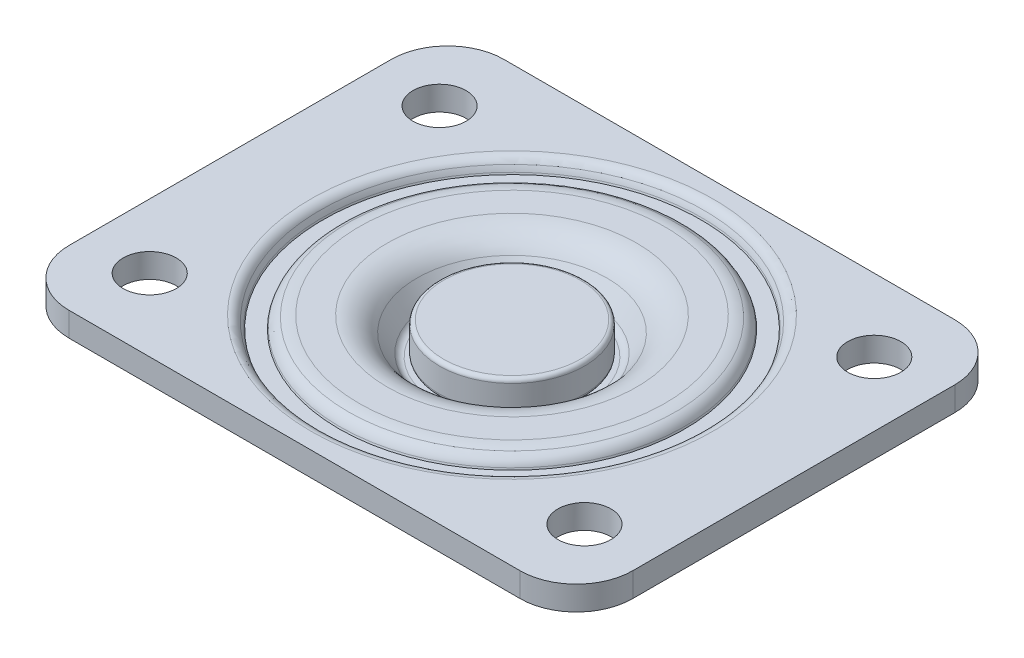
ISO-10303-21;
HEADER;
FILE_DESCRIPTION(('STEP AP214'),'2;1');
FILE_NAME('part.step','',(''),(''),'','','');
FILE_SCHEMA(('AUTOMOTIVE_DESIGN { 1 0 10303 214 1 1 1 1 }'));
ENDSEC;
DATA;
#1=APPLICATION_CONTEXT('core data for automotive mechanical design processes');
#2=APPLICATION_PROTOCOL_DEFINITION('international standard','automotive_design',2000,#1);
#3=PRODUCT_CONTEXT('',#1,'mechanical');
#4=PRODUCT('Part','Part','',(#3));
#5=PRODUCT_RELATED_PRODUCT_CATEGORY('part','',(#4));
#6=PRODUCT_DEFINITION_FORMATION('','',#4);
#7=PRODUCT_DEFINITION_CONTEXT('part definition',#1,'design');
#8=PRODUCT_DEFINITION('design','',#6,#7);
#9=PRODUCT_DEFINITION_SHAPE('','',#8);
#10=(LENGTH_UNIT() NAMED_UNIT(*) SI_UNIT(.MILLI.,.METRE.));
#11=(NAMED_UNIT(*) PLANE_ANGLE_UNIT() SI_UNIT($,.RADIAN.));
#12=(NAMED_UNIT(*) SI_UNIT($,.STERADIAN.) SOLID_ANGLE_UNIT());
#13=UNCERTAINTY_MEASURE_WITH_UNIT(LENGTH_MEASURE(1.E-05),#10,'distance_accuracy_value','');
#14=(GEOMETRIC_REPRESENTATION_CONTEXT(3) GLOBAL_UNCERTAINTY_ASSIGNED_CONTEXT((#13)) GLOBAL_UNIT_ASSIGNED_CONTEXT((#10,
#11,#12)) REPRESENTATION_CONTEXT('',''));
#15=CARTESIAN_POINT('',(0.,0.,0.));
#16=DIRECTION('',(0.,0.,1.));
#17=DIRECTION('',(1.,0.,0.));
#18=AXIS2_PLACEMENT_3D('',#15,#16,#17);
#19=CARTESIAN_POINT('',(0.,3.,0.));
#20=DIRECTION('',(0.,-1.,0.));
#21=DIRECTION('',(0.,0.,-1.));
#22=AXIS2_PLACEMENT_3D('',#19,#20,#21);
#23=PLANE('',#22);
#24=CARTESIAN_POINT('',(-27.,3.,18.));
#25=DIRECTION('',(0.,1.,0.));
#26=DIRECTION('',(0.,0.,1.));
#27=AXIS2_PLACEMENT_3D('',#24,#25,#26);
#28=CIRCLE('',#27,3.3);
#29=CARTESIAN_POINT('',(-27.,3.,21.3));
#30=VERTEX_POINT('',#29);
#31=EDGE_CURVE('E196',#30,#30,#28,.T.);
#32=ORIENTED_EDGE('',*,*,#31,.F.);
#33=EDGE_LOOP('',(#32));
#34=FACE_BOUND('',#33,.T.);
#35=CARTESIAN_POINT('',(27.,3.,18.));
#36=DIRECTION('',(0.,1.,0.));
#37=DIRECTION('',(0.,0.,1.));
#38=AXIS2_PLACEMENT_3D('',#35,#36,#37);
#39=CIRCLE('',#38,3.3);
#40=CARTESIAN_POINT('',(27.,3.,21.3));
#41=VERTEX_POINT('',#40);
#42=EDGE_CURVE('E192',#41,#41,#39,.T.);
#43=ORIENTED_EDGE('',*,*,#42,.F.);
#44=EDGE_LOOP('',(#43));
#45=FACE_BOUND('',#44,.T.);
#46=CARTESIAN_POINT('',(27.,3.,-18.));
#47=DIRECTION('',(0.,1.,0.));
#48=DIRECTION('',(0.,0.,1.));
#49=AXIS2_PLACEMENT_3D('',#46,#47,#48);
#50=CIRCLE('',#49,3.3);
#51=CARTESIAN_POINT('',(27.,3.,-14.7));
#52=VERTEX_POINT('',#51);
#53=EDGE_CURVE('E188',#52,#52,#50,.T.);
#54=ORIENTED_EDGE('',*,*,#53,.F.);
#55=EDGE_LOOP('',(#54));
#56=FACE_BOUND('',#55,.T.);
#57=CARTESIAN_POINT('',(-27.,3.,-18.));
#58=DIRECTION('',(0.,1.,0.));
#59=DIRECTION('',(0.,0.,1.));
#60=AXIS2_PLACEMENT_3D('',#57,#58,#59);
#61=CIRCLE('',#60,3.3);
#62=CARTESIAN_POINT('',(-27.,3.,-14.7));
#63=VERTEX_POINT('',#62);
#64=EDGE_CURVE('E184',#63,#63,#61,.T.);
#65=ORIENTED_EDGE('',*,*,#64,.F.);
#66=EDGE_LOOP('',(#65));
#67=FACE_BOUND('',#66,.T.);
#68=DIRECTION('',(0.,0.,-1.));
#69=VECTOR('',#68,1.);
#70=CARTESIAN_POINT('',(35.,3.,27.));
#71=LINE('',#70,#69);
#72=CARTESIAN_POINT('',(35.,3.,20.));
#73=VERTEX_POINT('',#72);
#74=CARTESIAN_POINT('',(35.,3.,-20.));
#75=VERTEX_POINT('',#74);
#76=EDGE_CURVE('E142',#73,#75,#71,.T.);
#77=ORIENTED_EDGE('',*,*,#76,.T.);
#78=CARTESIAN_POINT('',(28.,3.,-20.));
#79=DIRECTION('',(0.,-1.,0.));
#80=DIRECTION('',(0.,0.,-1.));
#81=AXIS2_PLACEMENT_3D('',#78,#79,#80);
#82=CIRCLE('',#81,7.);
#83=CARTESIAN_POINT('',(28.,3.,-27.));
#84=VERTEX_POINT('',#83);
#85=EDGE_CURVE('E168',#75,#84,#82,.F.);
#86=ORIENTED_EDGE('',*,*,#85,.T.);
#87=DIRECTION('',(-1.,0.,0.));
#88=VECTOR('',#87,1.);
#89=CARTESIAN_POINT('',(-35.,3.,-27.));
#90=LINE('',#89,#88);
#91=CARTESIAN_POINT('',(-28.,3.,-27.));
#92=VERTEX_POINT('',#91);
#93=EDGE_CURVE('E124',#84,#92,#90,.T.);
#94=ORIENTED_EDGE('',*,*,#93,.T.);
#95=CARTESIAN_POINT('',(-28.,3.,-20.));
#96=DIRECTION('',(0.,-1.,0.));
#97=DIRECTION('',(0.,0.,-1.));
#98=AXIS2_PLACEMENT_3D('',#95,#96,#97);
#99=CIRCLE('',#98,7.);
#100=CARTESIAN_POINT('',(-35.,3.,-20.));
#101=VERTEX_POINT('',#100);
#102=EDGE_CURVE('E164',#92,#101,#99,.F.);
#103=ORIENTED_EDGE('',*,*,#102,.T.);
#104=DIRECTION('',(0.,0.,1.));
#105=VECTOR('',#104,1.);
#106=CARTESIAN_POINT('',(-35.,3.,27.));
#107=LINE('',#106,#105);
#108=CARTESIAN_POINT('',(-35.,3.,20.));
#109=VERTEX_POINT('',#108);
#110=EDGE_CURVE('E310',#101,#109,#107,.T.);
#111=ORIENTED_EDGE('',*,*,#110,.T.);
#112=CARTESIAN_POINT('',(-28.,3.,20.));
#113=DIRECTION('',(0.,-1.,0.));
#114=DIRECTION('',(0.,0.,-1.));
#115=AXIS2_PLACEMENT_3D('',#112,#113,#114);
#116=CIRCLE('',#115,7.);
#117=CARTESIAN_POINT('',(-28.,3.,27.));
#118=VERTEX_POINT('',#117);
#119=EDGE_CURVE('E59',#109,#118,#116,.F.);
#120=ORIENTED_EDGE('',*,*,#119,.T.);
#121=DIRECTION('',(1.,0.,0.));
#122=VECTOR('',#121,1.);
#123=CARTESIAN_POINT('',(-35.,3.,27.));
#124=LINE('',#123,#122);
#125=CARTESIAN_POINT('',(28.,3.,27.));
#126=VERTEX_POINT('',#125);
#127=EDGE_CURVE('E147',#118,#126,#124,.T.);
#128=ORIENTED_EDGE('',*,*,#127,.T.);
#129=CARTESIAN_POINT('',(28.,3.,20.));
#130=DIRECTION('',(0.,-1.,0.));
#131=DIRECTION('',(0.,0.,-1.));
#132=AXIS2_PLACEMENT_3D('',#129,#130,#131);
#133=CIRCLE('',#132,7.);
#134=EDGE_CURVE('E166',#126,#73,#133,.F.);
#135=ORIENTED_EDGE('',*,*,#134,.T.);
#136=EDGE_LOOP('',(#77,#86,#94,#103,#111,#120,#128,#135));
#137=FACE_BOUND('',#136,.T.);
#138=CARTESIAN_POINT('',(0.,3.,0.));
#139=DIRECTION('',(0.,1.,0.));
#140=DIRECTION('',(0.,0.,1.));
#141=AXIS2_PLACEMENT_3D('',#138,#139,#140);
#142=CIRCLE('',#141,24.987277463445);
#143=CARTESIAN_POINT('',(0.,3.,24.987277463445));
#144=VERTEX_POINT('',#143);
#145=EDGE_CURVE('E267',#144,#144,#142,.T.);
#146=ORIENTED_EDGE('',*,*,#145,.F.);
#147=EDGE_LOOP('',(#146));
#148=FACE_BOUND('',#147,.T.);
#149=ADVANCED_FACE('F37',(#34,#45,#56,#67,#137,#148),#23,.F.);
#150=CARTESIAN_POINT('',(0.,0.,0.));
#151=DIRECTION('',(0.,-1.,0.));
#152=DIRECTION('',(0.,0.,-1.));
#153=AXIS2_PLACEMENT_3D('',#150,#151,#152);
#154=PLANE('',#153);
#155=CARTESIAN_POINT('',(0.,0.,0.));
#156=DIRECTION('',(0.,-1.,0.));
#157=DIRECTION('',(0.,0.,-1.));
#158=AXIS2_PLACEMENT_3D('',#155,#156,#157);
#159=CIRCLE('',#158,20.0013248654052);
#160=CARTESIAN_POINT('',(0.,0.,-20.0013248654052));
#161=VERTEX_POINT('',#160);
#162=EDGE_CURVE('E217',#161,#161,#159,.T.);
#163=ORIENTED_EDGE('',*,*,#162,.T.);
#164=EDGE_LOOP('',(#163));
#165=FACE_BOUND('',#164,.T.);
#166=CARTESIAN_POINT('',(0.,0.,0.));
#167=DIRECTION('',(0.,-1.,0.));
#168=DIRECTION('',(0.,0.,-1.));
#169=AXIS2_PLACEMENT_3D('',#166,#167,#168);
#170=CIRCLE('',#169,15.5308505758276);
#171=CARTESIAN_POINT('',(0.,0.,-15.5308505758276));
#172=VERTEX_POINT('',#171);
#173=EDGE_CURVE('E153',#172,#172,#170,.F.);
#174=ORIENTED_EDGE('',*,*,#173,.T.);
#175=EDGE_LOOP('',(#174));
#176=FACE_BOUND('',#175,.T.);
#177=ADVANCED_FACE('F234',(#165,#176),#154,.T.);
#178=CARTESIAN_POINT('',(-5.,-15.5,0.));
#179=DIRECTION('',(0.,1.,0.));
#180=DIRECTION('',(0.,0.,1.));
#181=AXIS2_PLACEMENT_3D('',#178,#179,#180);
#182=PLANE('',#181);
#183=CARTESIAN_POINT('',(0.,-15.5,0.));
#184=DIRECTION('',(0.,-1.,0.));
#185=DIRECTION('',(0.,0.,-1.));
#186=AXIS2_PLACEMENT_3D('',#183,#184,#185);
#187=CIRCLE('',#186,5.);
#188=CARTESIAN_POINT('',(0.,-15.5,-5.));
#189=VERTEX_POINT('',#188);
#190=EDGE_CURVE('E137',#189,#189,#187,.T.);
#191=ORIENTED_EDGE('',*,*,#190,.T.);
#192=EDGE_LOOP('',(#191));
#193=FACE_BOUND('',#192,.T.);
#194=ADVANCED_FACE('F241',(#193),#182,.F.);
#195=CARTESIAN_POINT('',(0.,-15.5,0.));
#196=DIRECTION('',(0.,-1.,0.));
#197=DIRECTION('',(0.,0.,-1.));
#198=AXIS2_PLACEMENT_3D('',#195,#196,#197);
#199=CYLINDRICAL_SURFACE('',#198,5.);
#200=ORIENTED_EDGE('',*,*,#190,.F.);
#201=EDGE_LOOP('',(#200));
#202=FACE_BOUND('',#201,.T.);
#203=CARTESIAN_POINT('',(0.,-4.5,0.));
#204=DIRECTION('',(0.,-1.,0.));
#205=DIRECTION('',(0.,0.,-1.));
#206=AXIS2_PLACEMENT_3D('',#203,#204,#205);
#207=CIRCLE('',#206,5.);
#208=CARTESIAN_POINT('',(0.,-4.5,-5.));
#209=VERTEX_POINT('',#208);
#210=EDGE_CURVE('E302',#209,#209,#207,.T.);
#211=ORIENTED_EDGE('',*,*,#210,.T.);
#212=EDGE_LOOP('',(#211));
#213=FACE_BOUND('',#212,.T.);
#214=ADVANCED_FACE('F398',(#202,#213),#199,.T.);
#215=CARTESIAN_POINT('',(-11.5990660780563,-4.5,0.));
#216=DIRECTION('',(0.,1.,0.));
#217=DIRECTION('',(0.,0.,1.));
#218=AXIS2_PLACEMENT_3D('',#215,#216,#217);
#219=PLANE('',#218);
#220=CARTESIAN_POINT('',(0.,-4.5,0.));
#221=DIRECTION('',(0.,1.,0.));
#222=DIRECTION('',(0.,0.,1.));
#223=AXIS2_PLACEMENT_3D('',#220,#221,#222);
#224=CIRCLE('',#223,9.51679787584933);
#225=CARTESIAN_POINT('',(0.,-4.5,9.51679787584933));
#226=VERTEX_POINT('',#225);
#227=EDGE_CURVE('E143',#226,#226,#224,.F.);
#228=ORIENTED_EDGE('',*,*,#227,.T.);
#229=EDGE_LOOP('',(#228));
#230=FACE_BOUND('',#229,.T.);
#231=ORIENTED_EDGE('',*,*,#210,.F.);
#232=EDGE_LOOP('',(#231));
#233=FACE_BOUND('',#232,.T.);
#234=ADVANCED_FACE('F394',(#230,#233),#219,.F.);
#235=CARTESIAN_POINT('',(0.,0.,0.));
#236=DIRECTION('',(0.,1.,0.));
#237=DIRECTION('',(0.,0.,1.));
#238=AXIS2_PLACEMENT_3D('',#235,#236,#237);
#239=CONICAL_SURFACE('',#238,14.75,0.610865238198013);
#240=CARTESIAN_POINT('',(0.,-0.639635345473431,0.));
#241=DIRECTION('',(0.,-1.,0.));
#242=DIRECTION('',(0.,0.,-1.));
#243=AXIS2_PLACEMENT_3D('',#240,#241,#242);
#244=CIRCLE('',#243,14.3021225093941);
#245=CARTESIAN_POINT('',(0.,-0.639635345473431,-14.3021225093941));
#246=VERTEX_POINT('',#245);
#247=EDGE_CURVE('E150',#246,#246,#244,.T.);
#248=ORIENTED_EDGE('',*,*,#247,.T.);
#249=EDGE_LOOP('',(#248));
#250=FACE_BOUND('',#249,.T.);
#251=CARTESIAN_POINT('',(0.,-2.79430574540418,0.));
#252=DIRECTION('',(0.,-1.,0.));
#253=DIRECTION('',(0.,0.,-1.));
#254=AXIS2_PLACEMENT_3D('',#251,#252,#253);
#255=CIRCLE('',#254,12.7934060530053);
#256=CARTESIAN_POINT('',(0.,-2.79430574540418,-12.7934060530053));
#257=VERTEX_POINT('',#256);
#258=EDGE_CURVE('E146',#257,#257,#255,.F.);
#259=ORIENTED_EDGE('',*,*,#258,.T.);
#260=EDGE_LOOP('',(#259));
#261=FACE_BOUND('',#260,.T.);
#262=ADVANCED_FACE('F390',(#250,#261),#239,.T.);
#263=CARTESIAN_POINT('',(0.,-0.5,0.));
#264=DIRECTION('',(0.,1.,0.));
#265=DIRECTION('',(0.,0.,1.));
#266=AXIS2_PLACEMENT_3D('',#263,#264,#265);
#267=TOROIDAL_SURFACE('',#266,9.51679787584933,4.);
#268=ORIENTED_EDGE('',*,*,#258,.F.);
#269=EDGE_LOOP('',(#268));
#270=FACE_BOUND('',#269,.T.);
#271=ORIENTED_EDGE('',*,*,#227,.F.);
#272=EDGE_LOOP('',(#271));
#273=FACE_BOUND('',#272,.T.);
#274=ADVANCED_FACE('F393',(#270,#273),#267,.T.);
#275=CARTESIAN_POINT('',(0.,-1.5,0.));
#276=DIRECTION('',(0.,-1.,0.));
#277=DIRECTION('',(0.,0.,-1.));
#278=AXIS2_PLACEMENT_3D('',#275,#276,#277);
#279=TOROIDAL_SURFACE('',#278,15.5308505758276,1.5);
#280=ORIENTED_EDGE('',*,*,#173,.F.);
#281=EDGE_LOOP('',(#280));
#282=FACE_BOUND('',#281,.T.);
#283=ORIENTED_EDGE('',*,*,#247,.F.);
#284=EDGE_LOOP('',(#283));
#285=FACE_BOUND('',#284,.T.);
#286=ADVANCED_FACE('F388',(#282,#285),#279,.F.);
#287=CARTESIAN_POINT('',(0.,0.,0.));
#288=DIRECTION('',(0.,-1.,0.));
#289=DIRECTION('',(0.,0.,-1.));
#290=AXIS2_PLACEMENT_3D('',#287,#288,#289);
#291=CONICAL_SURFACE('',#290,20.29,0.5235987755983);
#292=CARTESIAN_POINT('',(0.,-0.250000000000007,0.));
#293=DIRECTION('',(0.,1.,0.));
#294=DIRECTION('',(0.,0.,1.));
#295=AXIS2_PLACEMENT_3D('',#292,#293,#294);
#296=CIRCLE('',#295,20.4343375672974);
#297=CARTESIAN_POINT('',(0.,-0.250000000000007,20.4343375672974));
#298=VERTEX_POINT('',#297);
#299=EDGE_CURVE('E214',#298,#298,#296,.T.);
#300=ORIENTED_EDGE('',*,*,#299,.T.);
#301=EDGE_LOOP('',(#300));
#302=FACE_BOUND('',#301,.T.);
#303=CARTESIAN_POINT('',(0.,-0.367473300878591,0.));
#304=DIRECTION('',(0.,1.,0.));
#305=DIRECTION('',(0.,0.,1.));
#306=AXIS2_PLACEMENT_3D('',#303,#304,#305);
#307=CIRCLE('',#306,20.5021608091823);
#308=CARTESIAN_POINT('',(0.,-0.367473300878591,20.5021608091823));
#309=VERTEX_POINT('',#308);
#310=EDGE_CURVE('E299',#309,#309,#307,.T.);
#311=ORIENTED_EDGE('',*,*,#310,.F.);
#312=EDGE_LOOP('',(#311));
#313=FACE_BOUND('',#312,.T.);
#314=ADVANCED_FACE('F384',(#302,#313),#291,.F.);
#315=CARTESIAN_POINT('',(0.,0.797526699121403,0.));
#316=DIRECTION('',(0.,1.,0.));
#317=DIRECTION('',(0.,0.,1.));
#318=AXIS2_PLACEMENT_3D('',#315,#316,#317);
#319=TOROIDAL_SURFACE('',#318,22.52,2.33);
#320=CARTESIAN_POINT('',(0.,-0.367473300878607,0.));
#321=DIRECTION('',(0.,1.,0.));
#322=DIRECTION('',(0.,0.,1.));
#323=AXIS2_PLACEMENT_3D('',#320,#321,#322);
#324=CIRCLE('',#323,24.5378391908177);
#325=CARTESIAN_POINT('',(0.,-0.367473300878607,24.5378391908177));
#326=VERTEX_POINT('',#325);
#327=EDGE_CURVE('E296',#326,#326,#324,.T.);
#328=ORIENTED_EDGE('',*,*,#327,.F.);
#329=EDGE_LOOP('',(#328));
#330=FACE_BOUND('',#329,.T.);
#331=ORIENTED_EDGE('',*,*,#310,.T.);
#332=EDGE_LOOP('',(#331));
#333=FACE_BOUND('',#332,.T.);
#334=ADVANCED_FACE('F340',(#330,#333),#319,.T.);
#335=CARTESIAN_POINT('',(0.,-0.367473300878607,0.));
#336=DIRECTION('',(0.,1.,0.));
#337=DIRECTION('',(0.,0.,1.));
#338=AXIS2_PLACEMENT_3D('',#335,#336,#337);
#339=CONICAL_SURFACE('',#338,24.5378391908177,0.523598775598302);
#340=CARTESIAN_POINT('',(0.,-0.25,0.));
#341=DIRECTION('',(0.,-1.,0.));
#342=DIRECTION('',(0.,0.,-1.));
#343=AXIS2_PLACEMENT_3D('',#340,#341,#342);
#344=CIRCLE('',#343,24.6056624327026);
#345=CARTESIAN_POINT('',(0.,-0.25,-24.6056624327026));
#346=VERTEX_POINT('',#345);
#347=EDGE_CURVE('E11',#346,#346,#344,.T.);
#348=ORIENTED_EDGE('',*,*,#347,.T.);
#349=EDGE_LOOP('',(#348));
#350=FACE_BOUND('',#349,.T.);
#351=ORIENTED_EDGE('',*,*,#327,.T.);
#352=EDGE_LOOP('',(#351));
#353=FACE_BOUND('',#352,.T.);
#354=ADVANCED_FACE('F333',(#350,#353),#339,.T.);
#355=CARTESIAN_POINT('',(-28.,3.,-20.));
#356=DIRECTION('',(0.,-1.,0.));
#357=DIRECTION('',(0.,0.,-1.));
#358=AXIS2_PLACEMENT_3D('',#355,#356,#357);
#359=CYLINDRICAL_SURFACE('',#358,7.);
#360=ORIENTED_EDGE('',*,*,#102,.F.);
#361=DIRECTION('',(0.,-1.,0.));
#362=VECTOR('',#361,1.);
#363=CARTESIAN_POINT('',(-28.,3.,-27.));
#364=LINE('',#363,#362);
#365=CARTESIAN_POINT('',(-28.,0.,-27.));
#366=VERTEX_POINT('',#365);
#367=EDGE_CURVE('E126',#366,#92,#364,.F.);
#368=ORIENTED_EDGE('',*,*,#367,.F.);
#369=CARTESIAN_POINT('',(-28.,0.,-20.));
#370=DIRECTION('',(0.,-1.,0.));
#371=DIRECTION('',(0.,0.,-1.));
#372=AXIS2_PLACEMENT_3D('',#369,#370,#371);
#373=CIRCLE('',#372,7.);
#374=CARTESIAN_POINT('',(-35.,0.,-20.));
#375=VERTEX_POINT('',#374);
#376=EDGE_CURVE('E130',#375,#366,#373,.T.);
#377=ORIENTED_EDGE('',*,*,#376,.F.);
#378=DIRECTION('',(0.,-1.,0.));
#379=VECTOR('',#378,1.);
#380=CARTESIAN_POINT('',(-35.,3.,-20.));
#381=LINE('',#380,#379);
#382=EDGE_CURVE('E176',#101,#375,#381,.T.);
#383=ORIENTED_EDGE('',*,*,#382,.F.);
#384=EDGE_LOOP('',(#360,#368,#377,#383));
#385=FACE_BOUND('',#384,.T.);
#386=ADVANCED_FACE('F331',(#385),#359,.T.);
#387=CARTESIAN_POINT('',(-35.,3.,27.));
#388=DIRECTION('',(1.,0.,0.));
#389=DIRECTION('',(0.,0.,-1.));
#390=AXIS2_PLACEMENT_3D('',#387,#388,#389);
#391=PLANE('',#390);
#392=ORIENTED_EDGE('',*,*,#110,.F.);
#393=ORIENTED_EDGE('',*,*,#382,.T.);
#394=DIRECTION('',(0.,0.,1.));
#395=VECTOR('',#394,1.);
#396=CARTESIAN_POINT('',(-35.,0.,27.));
#397=LINE('',#396,#395);
#398=CARTESIAN_POINT('',(-35.,0.,20.));
#399=VERTEX_POINT('',#398);
#400=EDGE_CURVE('E131',#375,#399,#397,.T.);
#401=ORIENTED_EDGE('',*,*,#400,.T.);
#402=DIRECTION('',(0.,-1.,0.));
#403=VECTOR('',#402,1.);
#404=CARTESIAN_POINT('',(-35.,3.,20.));
#405=LINE('',#404,#403);
#406=EDGE_CURVE('E174',#399,#109,#405,.F.);
#407=ORIENTED_EDGE('',*,*,#406,.T.);
#408=EDGE_LOOP('',(#392,#393,#401,#407));
#409=FACE_BOUND('',#408,.T.);
#410=ADVANCED_FACE('F327',(#409),#391,.F.);
#411=CARTESIAN_POINT('',(-28.,3.,20.));
#412=DIRECTION('',(0.,-1.,0.));
#413=DIRECTION('',(0.,0.,-1.));
#414=AXIS2_PLACEMENT_3D('',#411,#412,#413);
#415=CYLINDRICAL_SURFACE('',#414,7.);
#416=ORIENTED_EDGE('',*,*,#119,.F.);
#417=ORIENTED_EDGE('',*,*,#406,.F.);
#418=CARTESIAN_POINT('',(-28.,0.,20.));
#419=DIRECTION('',(0.,-1.,0.));
#420=DIRECTION('',(0.,0.,-1.));
#421=AXIS2_PLACEMENT_3D('',#418,#419,#420);
#422=CIRCLE('',#421,7.);
#423=CARTESIAN_POINT('',(-28.,0.,27.));
#424=VERTEX_POINT('',#423);
#425=EDGE_CURVE('E125',#424,#399,#422,.T.);
#426=ORIENTED_EDGE('',*,*,#425,.F.);
#427=DIRECTION('',(0.,-1.,0.));
#428=VECTOR('',#427,1.);
#429=CARTESIAN_POINT('',(-28.,3.,27.));
#430=LINE('',#429,#428);
#431=EDGE_CURVE('E170',#118,#424,#430,.T.);
#432=ORIENTED_EDGE('',*,*,#431,.F.);
#433=EDGE_LOOP('',(#416,#417,#426,#432));
#434=FACE_BOUND('',#433,.T.);
#435=ADVANCED_FACE('F323',(#434),#415,.T.);
#436=CARTESIAN_POINT('',(-35.,3.,27.));
#437=DIRECTION('',(0.,0.,-1.));
#438=DIRECTION('',(-1.,0.,0.));
#439=AXIS2_PLACEMENT_3D('',#436,#437,#438);
#440=PLANE('',#439);
#441=DIRECTION('',(1.,0.,0.));
#442=VECTOR('',#441,1.);
#443=CARTESIAN_POINT('',(-35.,0.,27.));
#444=LINE('',#443,#442);
#445=CARTESIAN_POINT('',(28.,0.,27.));
#446=VERTEX_POINT('',#445);
#447=EDGE_CURVE('E135',#424,#446,#444,.T.);
#448=ORIENTED_EDGE('',*,*,#447,.T.);
#449=DIRECTION('',(0.,-1.,0.));
#450=VECTOR('',#449,1.);
#451=CARTESIAN_POINT('',(28.,3.,27.));
#452=LINE('',#451,#450);
#453=EDGE_CURVE('E52',#446,#126,#452,.F.);
#454=ORIENTED_EDGE('',*,*,#453,.T.);
#455=ORIENTED_EDGE('',*,*,#127,.F.);
#456=ORIENTED_EDGE('',*,*,#431,.T.);
#457=EDGE_LOOP('',(#448,#454,#455,#456));
#458=FACE_BOUND('',#457,.T.);
#459=ADVANCED_FACE('F321',(#458),#440,.F.);
#460=CARTESIAN_POINT('',(28.,3.,20.));
#461=DIRECTION('',(0.,-1.,0.));
#462=DIRECTION('',(0.,0.,-1.));
#463=AXIS2_PLACEMENT_3D('',#460,#461,#462);
#464=CYLINDRICAL_SURFACE('',#463,7.);
#465=ORIENTED_EDGE('',*,*,#134,.F.);
#466=ORIENTED_EDGE('',*,*,#453,.F.);
#467=CARTESIAN_POINT('',(28.,0.,20.));
#468=DIRECTION('',(0.,-1.,0.));
#469=DIRECTION('',(0.,0.,-1.));
#470=AXIS2_PLACEMENT_3D('',#467,#468,#469);
#471=CIRCLE('',#470,7.);
#472=CARTESIAN_POINT('',(35.,0.,20.));
#473=VERTEX_POINT('',#472);
#474=EDGE_CURVE('E115',#473,#446,#471,.T.);
#475=ORIENTED_EDGE('',*,*,#474,.F.);
#476=DIRECTION('',(0.,-1.,0.));
#477=VECTOR('',#476,1.);
#478=CARTESIAN_POINT('',(35.,3.,20.));
#479=LINE('',#478,#477);
#480=EDGE_CURVE('E114',#73,#473,#479,.T.);
#481=ORIENTED_EDGE('',*,*,#480,.F.);
#482=EDGE_LOOP('',(#465,#466,#475,#481));
#483=FACE_BOUND('',#482,.T.);
#484=ADVANCED_FACE('F317',(#483),#464,.T.);
#485=CARTESIAN_POINT('',(35.,3.,27.));
#486=DIRECTION('',(-1.,0.,0.));
#487=DIRECTION('',(0.,0.,1.));
#488=AXIS2_PLACEMENT_3D('',#485,#486,#487);
#489=PLANE('',#488);
#490=DIRECTION('',(0.,0.,-1.));
#491=VECTOR('',#490,1.);
#492=CARTESIAN_POINT('',(35.,0.,27.));
#493=LINE('',#492,#491);
#494=CARTESIAN_POINT('',(35.,0.,-20.));
#495=VERTEX_POINT('',#494);
#496=EDGE_CURVE('E132',#473,#495,#493,.T.);
#497=ORIENTED_EDGE('',*,*,#496,.T.);
#498=DIRECTION('',(0.,-1.,0.));
#499=VECTOR('',#498,1.);
#500=CARTESIAN_POINT('',(35.,3.,-20.));
#501=LINE('',#500,#499);
#502=EDGE_CURVE('E109',#495,#75,#501,.F.);
#503=ORIENTED_EDGE('',*,*,#502,.T.);
#504=ORIENTED_EDGE('',*,*,#76,.F.);
#505=ORIENTED_EDGE('',*,*,#480,.T.);
#506=EDGE_LOOP('',(#497,#503,#504,#505));
#507=FACE_BOUND('',#506,.T.);
#508=ADVANCED_FACE('F319',(#507),#489,.F.);
#509=CARTESIAN_POINT('',(28.,3.,-20.));
#510=DIRECTION('',(0.,-1.,0.));
#511=DIRECTION('',(0.,0.,-1.));
#512=AXIS2_PLACEMENT_3D('',#509,#510,#511);
#513=CYLINDRICAL_SURFACE('',#512,7.);
#514=ORIENTED_EDGE('',*,*,#85,.F.);
#515=ORIENTED_EDGE('',*,*,#502,.F.);
#516=CARTESIAN_POINT('',(28.,0.,-20.));
#517=DIRECTION('',(0.,-1.,0.));
#518=DIRECTION('',(0.,0.,-1.));
#519=AXIS2_PLACEMENT_3D('',#516,#517,#518);
#520=CIRCLE('',#519,7.);
#521=CARTESIAN_POINT('',(28.,0.,-27.));
#522=VERTEX_POINT('',#521);
#523=EDGE_CURVE('E104',#522,#495,#520,.T.);
#524=ORIENTED_EDGE('',*,*,#523,.F.);
#525=DIRECTION('',(0.,-1.,0.));
#526=VECTOR('',#525,1.);
#527=CARTESIAN_POINT('',(28.,3.,-27.));
#528=LINE('',#527,#526);
#529=EDGE_CURVE('E108',#84,#522,#528,.T.);
#530=ORIENTED_EDGE('',*,*,#529,.F.);
#531=EDGE_LOOP('',(#514,#515,#524,#530));
#532=FACE_BOUND('',#531,.T.);
#533=ADVANCED_FACE('F107',(#532),#513,.T.);
#534=CARTESIAN_POINT('',(-35.,3.,-27.));
#535=DIRECTION('',(0.,0.,1.));
#536=DIRECTION('',(1.,0.,0.));
#537=AXIS2_PLACEMENT_3D('',#534,#535,#536);
#538=PLANE('',#537);
#539=ORIENTED_EDGE('',*,*,#93,.F.);
#540=ORIENTED_EDGE('',*,*,#529,.T.);
#541=DIRECTION('',(-1.,0.,0.));
#542=VECTOR('',#541,1.);
#543=CARTESIAN_POINT('',(-35.,0.,-27.));
#544=LINE('',#543,#542);
#545=EDGE_CURVE('E121',#522,#366,#544,.T.);
#546=ORIENTED_EDGE('',*,*,#545,.T.);
#547=ORIENTED_EDGE('',*,*,#367,.T.);
#548=EDGE_LOOP('',(#539,#540,#546,#547));
#549=FACE_BOUND('',#548,.T.);
#550=ADVANCED_FACE('F120',(#549),#538,.F.);
#551=CARTESIAN_POINT('',(0.,0.,0.));
#552=DIRECTION('',(0.,-1.,0.));
#553=DIRECTION('',(0.,0.,-1.));
#554=AXIS2_PLACEMENT_3D('',#551,#552,#553);
#555=CIRCLE('',#554,25.0386751345948);
#556=CARTESIAN_POINT('',(0.,0.,-25.0386751345948));
#557=VERTEX_POINT('',#556);
#558=EDGE_CURVE('E45',#557,#557,#555,.F.);
#559=ORIENTED_EDGE('',*,*,#558,.T.);
#560=EDGE_LOOP('',(#559));
#561=FACE_BOUND('',#560,.T.);
#562=CARTESIAN_POINT('',(-27.,0.,18.));
#563=DIRECTION('',(0.,-1.,0.));
#564=DIRECTION('',(0.,0.,-1.));
#565=AXIS2_PLACEMENT_3D('',#562,#563,#564);
#566=CIRCLE('',#565,3.3);
#567=CARTESIAN_POINT('',(-27.,0.,14.7));
#568=VERTEX_POINT('',#567);
#569=EDGE_CURVE('E193',#568,#568,#566,.T.);
#570=ORIENTED_EDGE('',*,*,#569,.F.);
#571=EDGE_LOOP('',(#570));
#572=FACE_BOUND('',#571,.T.);
#573=CARTESIAN_POINT('',(27.,0.,18.));
#574=DIRECTION('',(0.,-1.,0.));
#575=DIRECTION('',(0.,0.,-1.));
#576=AXIS2_PLACEMENT_3D('',#573,#574,#575);
#577=CIRCLE('',#576,3.3);
#578=CARTESIAN_POINT('',(27.,0.,14.7));
#579=VERTEX_POINT('',#578);
#580=EDGE_CURVE('E189',#579,#579,#577,.T.);
#581=ORIENTED_EDGE('',*,*,#580,.F.);
#582=EDGE_LOOP('',(#581));
#583=FACE_BOUND('',#582,.T.);
#584=CARTESIAN_POINT('',(27.,0.,-18.));
#585=DIRECTION('',(0.,-1.,0.));
#586=DIRECTION('',(0.,0.,-1.));
#587=AXIS2_PLACEMENT_3D('',#584,#585,#586);
#588=CIRCLE('',#587,3.3);
#589=CARTESIAN_POINT('',(27.,0.,-21.3));
#590=VERTEX_POINT('',#589);
#591=EDGE_CURVE('E185',#590,#590,#588,.T.);
#592=ORIENTED_EDGE('',*,*,#591,.F.);
#593=EDGE_LOOP('',(#592));
#594=FACE_BOUND('',#593,.T.);
#595=CARTESIAN_POINT('',(-27.,0.,-18.));
#596=DIRECTION('',(0.,-1.,0.));
#597=DIRECTION('',(0.,0.,-1.));
#598=AXIS2_PLACEMENT_3D('',#595,#596,#597);
#599=CIRCLE('',#598,3.3);
#600=CARTESIAN_POINT('',(-27.,0.,-21.3));
#601=VERTEX_POINT('',#600);
#602=EDGE_CURVE('E180',#601,#601,#599,.T.);
#603=ORIENTED_EDGE('',*,*,#602,.F.);
#604=EDGE_LOOP('',(#603));
#605=FACE_BOUND('',#604,.T.);
#606=ORIENTED_EDGE('',*,*,#545,.F.);
#607=ORIENTED_EDGE('',*,*,#523,.T.);
#608=ORIENTED_EDGE('',*,*,#496,.F.);
#609=ORIENTED_EDGE('',*,*,#474,.T.);
#610=ORIENTED_EDGE('',*,*,#447,.F.);
#611=ORIENTED_EDGE('',*,*,#425,.T.);
#612=ORIENTED_EDGE('',*,*,#400,.F.);
#613=ORIENTED_EDGE('',*,*,#376,.T.);
#614=EDGE_LOOP('',(#606,#607,#608,#609,#610,#611,#612,#613));
#615=FACE_BOUND('',#614,.T.);
#616=ADVANCED_FACE('F128',(#561,#572,#583,#594,#605,#615),#154,.T.);
#617=CARTESIAN_POINT('',(0.,1.1,0.));
#618=DIRECTION('',(0.,1.,0.));
#619=DIRECTION('',(0.,0.,1.));
#620=AXIS2_PLACEMENT_3D('',#617,#618,#619);
#621=TOROIDAL_SURFACE('',#620,19.75,1.77);
#622=CARTESIAN_POINT('',(0.,1.70537565368643,0.));
#623=DIRECTION('',(0.,1.,0.));
#624=DIRECTION('',(0.,0.,1.));
#625=AXIS2_PLACEMENT_3D('',#622,#623,#624);
#626=CIRCLE('',#625,21.4132559387911);
#627=CARTESIAN_POINT('',(0.,1.70537565368643,21.4132559387911));
#628=VERTEX_POINT('',#627);
#629=EDGE_CURVE('E287',#628,#628,#626,.T.);
#630=ORIENTED_EDGE('',*,*,#629,.T.);
#631=EDGE_LOOP('',(#630));
#632=FACE_BOUND('',#631,.T.);
#633=CARTESIAN_POINT('',(0.,2.76681614349776,0.));
#634=DIRECTION('',(0.,1.,0.));
#635=DIRECTION('',(0.,0.,1.));
#636=AXIS2_PLACEMENT_3D('',#633,#634,#635);
#637=CIRCLE('',#636,20.3455031013985);
#638=CARTESIAN_POINT('',(0.,2.76681614349776,20.3455031013985));
#639=VERTEX_POINT('',#638);
#640=EDGE_CURVE('E183',#639,#639,#637,.T.);
#641=ORIENTED_EDGE('',*,*,#640,.F.);
#642=EDGE_LOOP('',(#641));
#643=FACE_BOUND('',#642,.T.);
#644=ADVANCED_FACE('F463',(#632,#643),#621,.T.);
#645=CARTESIAN_POINT('',(0.,1.70537565368643,0.));
#646=DIRECTION('',(0.,-1.,0.));
#647=DIRECTION('',(0.,0.,-1.));
#648=AXIS2_PLACEMENT_3D('',#645,#646,#647);
#649=CONICAL_SURFACE('',#648,21.4132559387911,0.349065850398862);
#650=CARTESIAN_POINT('',(0.,1.5,0.));
#651=DIRECTION('',(0.,1.,0.));
#652=DIRECTION('',(0.,0.,1.));
#653=AXIS2_PLACEMENT_3D('',#650,#651,#652);
#654=CIRCLE('',#653,21.4880065635759);
#655=CARTESIAN_POINT('',(0.,1.5,21.4880065635759));
#656=VERTEX_POINT('',#655);
#657=EDGE_CURVE('E284',#656,#656,#654,.T.);
#658=ORIENTED_EDGE('',*,*,#657,.T.);
#659=EDGE_LOOP('',(#658));
#660=FACE_BOUND('',#659,.T.);
#661=ORIENTED_EDGE('',*,*,#629,.F.);
#662=EDGE_LOOP('',(#661));
#663=FACE_BOUND('',#662,.T.);
#664=ADVANCED_FACE('F593',(#660,#663),#649,.T.);
#665=CARTESIAN_POINT('',(0.,1.5,-21.4880065635759));
#666=DIRECTION('',(0.,1.,0.));
#667=DIRECTION('',(0.,0.,1.));
#668=AXIS2_PLACEMENT_3D('',#665,#666,#667);
#669=PLANE('',#668);
#670=CARTESIAN_POINT('',(0.,1.5,0.));
#671=DIRECTION('',(0.,1.,0.));
#672=DIRECTION('',(0.,0.,1.));
#673=AXIS2_PLACEMENT_3D('',#670,#671,#672);
#674=CIRCLE('',#673,23.4880065635759);
#675=CARTESIAN_POINT('',(0.,1.5,23.4880065635759));
#676=VERTEX_POINT('',#675);
#677=EDGE_CURVE('E281',#676,#676,#674,.T.);
#678=ORIENTED_EDGE('',*,*,#677,.T.);
#679=EDGE_LOOP('',(#678));
#680=FACE_BOUND('',#679,.T.);
#681=ORIENTED_EDGE('',*,*,#657,.F.);
#682=EDGE_LOOP('',(#681));
#683=FACE_BOUND('',#682,.T.);
#684=ADVANCED_FACE('F583',(#680,#683),#669,.T.);
#685=CARTESIAN_POINT('',(0.,1.5,0.));
#686=DIRECTION('',(0.,1.,0.));
#687=DIRECTION('',(0.,0.,1.));
#688=AXIS2_PLACEMENT_3D('',#685,#686,#687);
#689=CONICAL_SURFACE('',#688,23.4880065635759,0.349065850398888);
#690=CARTESIAN_POINT('',(0.,1.70332500483434,0.));
#691=DIRECTION('',(0.,1.,0.));
#692=DIRECTION('',(0.,0.,1.));
#693=AXIS2_PLACEMENT_3D('',#690,#691,#692);
#694=CIRCLE('',#693,23.5620108132176);
#695=CARTESIAN_POINT('',(0.,1.70332500483434,23.5620108132176));
#696=VERTEX_POINT('',#695);
#697=EDGE_CURVE('E278',#696,#696,#694,.T.);
#698=ORIENTED_EDGE('',*,*,#697,.T.);
#699=EDGE_LOOP('',(#698));
#700=FACE_BOUND('',#699,.T.);
#701=ORIENTED_EDGE('',*,*,#677,.F.);
#702=EDGE_LOOP('',(#701));
#703=FACE_BOUND('',#702,.T.);
#704=ADVANCED_FACE('F573',(#700,#703),#689,.F.);
#705=CARTESIAN_POINT('',(0.,0.26,0.));
#706=DIRECTION('',(0.,1.,0.));
#707=DIRECTION('',(0.,0.,1.));
#708=AXIS2_PLACEMENT_3D('',#705,#706,#707);
#709=TOROIDAL_SURFACE('',#708,27.5275136729341,4.22);
#710=CARTESIAN_POINT('',(0.,2.34109589041096,0.));
#711=DIRECTION('',(0.,1.,0.));
#712=DIRECTION('',(0.,0.,1.));
#713=AXIS2_PLACEMENT_3D('',#710,#711,#712);
#714=CIRCLE('',#713,23.8563503838778);
#715=CARTESIAN_POINT('',(0.,2.34109589041096,23.8563503838778));
#716=VERTEX_POINT('',#715);
#717=EDGE_CURVE('E270',#716,#716,#714,.T.);
#718=ORIENTED_EDGE('',*,*,#717,.T.);
#719=EDGE_LOOP('',(#718));
#720=FACE_BOUND('',#719,.T.);
#721=ORIENTED_EDGE('',*,*,#697,.F.);
#722=EDGE_LOOP('',(#721));
#723=FACE_BOUND('',#722,.T.);
#724=ADVANCED_FACE('F563',(#720,#723),#709,.T.);
#725=CARTESIAN_POINT('',(0.,1.7,0.));
#726=DIRECTION('',(0.,1.,0.));
#727=DIRECTION('',(0.,0.,1.));
#728=AXIS2_PLACEMENT_3D('',#725,#726,#727);
#729=TOROIDAL_SURFACE('',#728,24.987277463445,1.3);
#730=ORIENTED_EDGE('',*,*,#145,.T.);
#731=EDGE_LOOP('',(#730));
#732=FACE_BOUND('',#731,.T.);
#733=ORIENTED_EDGE('',*,*,#717,.F.);
#734=EDGE_LOOP('',(#733));
#735=FACE_BOUND('',#734,.T.);
#736=ADVANCED_FACE('F377',(#732,#735),#729,.T.);
#737=CARTESIAN_POINT('',(0.,-1.,0.));
#738=DIRECTION('',(0.,1.,0.));
#739=DIRECTION('',(0.,0.,1.));
#740=AXIS2_PLACEMENT_3D('',#737,#738,#739);
#741=TOROIDAL_SURFACE('',#740,18.9997333807239,4.);
#742=ORIENTED_EDGE('',*,*,#640,.T.);
#743=EDGE_LOOP('',(#742));
#744=FACE_BOUND('',#743,.T.);
#745=CARTESIAN_POINT('',(0.,3.,0.));
#746=DIRECTION('',(0.,1.,0.));
#747=DIRECTION('',(0.,0.,1.));
#748=AXIS2_PLACEMENT_3D('',#745,#746,#747);
#749=CIRCLE('',#748,18.9997333807239);
#750=CARTESIAN_POINT('',(0.,3.,18.9997333807239));
#751=VERTEX_POINT('',#750);
#752=EDGE_CURVE('E265',#751,#751,#749,.T.);
#753=ORIENTED_EDGE('',*,*,#752,.F.);
#754=EDGE_LOOP('',(#753));
#755=FACE_BOUND('',#754,.T.);
#756=ADVANCED_FACE('F368',(#744,#755),#741,.T.);
#757=CARTESIAN_POINT('',(0.,2.5,0.));
#758=DIRECTION('',(0.,1.,0.));
#759=DIRECTION('',(0.,0.,1.));
#760=AXIS2_PLACEMENT_3D('',#757,#758,#759);
#761=PLANE('',#760);
#762=CARTESIAN_POINT('',(0.,2.5,0.));
#763=DIRECTION('',(0.,1.,0.));
#764=DIRECTION('',(0.,0.,1.));
#765=AXIS2_PLACEMENT_3D('',#762,#763,#764);
#766=CIRCLE('',#765,8.5);
#767=CARTESIAN_POINT('',(0.,2.5,8.5));
#768=VERTEX_POINT('',#767);
#769=EDGE_CURVE('E208',#768,#768,#766,.T.);
#770=ORIENTED_EDGE('',*,*,#769,.T.);
#771=EDGE_LOOP('',(#770));
#772=FACE_BOUND('',#771,.T.);
#773=ADVANCED_FACE('F365',(#772),#761,.T.);
#774=CARTESIAN_POINT('',(0.,3.925,0.));
#775=DIRECTION('',(0.,1.,0.));
#776=DIRECTION('',(0.,0.,1.));
#777=AXIS2_PLACEMENT_3D('',#774,#775,#776);
#778=CYLINDRICAL_SURFACE('',#777,9.);
#779=CARTESIAN_POINT('',(0.,2.,0.));
#780=DIRECTION('',(0.,1.,0.));
#781=DIRECTION('',(0.,0.,1.));
#782=AXIS2_PLACEMENT_3D('',#779,#780,#781);
#783=CIRCLE('',#782,9.);
#784=CARTESIAN_POINT('',(0.,2.,9.));
#785=VERTEX_POINT('',#784);
#786=EDGE_CURVE('E211',#785,#785,#783,.F.);
#787=ORIENTED_EDGE('',*,*,#786,.T.);
#788=EDGE_LOOP('',(#787));
#789=FACE_BOUND('',#788,.T.);
#790=CARTESIAN_POINT('',(0.,-1.,0.));
#791=DIRECTION('',(0.,1.,0.));
#792=DIRECTION('',(0.,0.,1.));
#793=AXIS2_PLACEMENT_3D('',#790,#791,#792);
#794=CIRCLE('',#793,9.);
#795=CARTESIAN_POINT('',(0.,-1.,9.));
#796=VERTEX_POINT('',#795);
#797=EDGE_CURVE('E293',#796,#796,#794,.T.);
#798=ORIENTED_EDGE('',*,*,#797,.T.);
#799=EDGE_LOOP('',(#798));
#800=FACE_BOUND('',#799,.T.);
#801=ADVANCED_FACE('F367',(#789,#800),#778,.T.);
#802=CARTESIAN_POINT('',(0.,-1.,0.));
#803=DIRECTION('',(0.,1.,0.));
#804=DIRECTION('',(0.,0.,1.));
#805=AXIS2_PLACEMENT_3D('',#802,#803,#804);
#806=TOROIDAL_SURFACE('',#805,8.5,0.5);
#807=CARTESIAN_POINT('',(0.,-1.5,0.));
#808=DIRECTION('',(0.,1.,0.));
#809=DIRECTION('',(0.,0.,1.));
#810=AXIS2_PLACEMENT_3D('',#807,#808,#809);
#811=CIRCLE('',#810,8.5);
#812=CARTESIAN_POINT('',(0.,-1.5,8.5));
#813=VERTEX_POINT('',#812);
#814=EDGE_CURVE('E290',#813,#813,#811,.T.);
#815=ORIENTED_EDGE('',*,*,#814,.T.);
#816=EDGE_LOOP('',(#815));
#817=FACE_BOUND('',#816,.T.);
#818=ORIENTED_EDGE('',*,*,#797,.F.);
#819=EDGE_LOOP('',(#818));
#820=FACE_BOUND('',#819,.T.);
#821=ADVANCED_FACE('F374',(#817,#820),#806,.T.);
#822=CARTESIAN_POINT('',(0.,-1.5,-8.5));
#823=DIRECTION('',(0.,1.,0.));
#824=DIRECTION('',(0.,0.,1.));
#825=AXIS2_PLACEMENT_3D('',#822,#823,#824);
#826=PLANE('',#825);
#827=CARTESIAN_POINT('',(0.,-1.5,0.));
#828=DIRECTION('',(0.,1.,0.));
#829=DIRECTION('',(0.,0.,1.));
#830=AXIS2_PLACEMENT_3D('',#827,#828,#829);
#831=CIRCLE('',#830,9.47849902750458);
#832=CARTESIAN_POINT('',(0.,-1.5,9.47849902750458));
#833=VERTEX_POINT('',#832);
#834=EDGE_CURVE('E202',#833,#833,#831,.T.);
#835=ORIENTED_EDGE('',*,*,#834,.T.);
#836=EDGE_LOOP('',(#835));
#837=FACE_BOUND('',#836,.T.);
#838=ORIENTED_EDGE('',*,*,#814,.F.);
#839=EDGE_LOOP('',(#838));
#840=FACE_BOUND('',#839,.T.);
#841=ADVANCED_FACE('F258',(#837,#840),#826,.T.);
#842=CARTESIAN_POINT('',(0.,-1.5,0.));
#843=DIRECTION('',(0.,1.,0.));
#844=DIRECTION('',(0.,0.,1.));
#845=AXIS2_PLACEMENT_3D('',#842,#843,#844);
#846=CONICAL_SURFACE('',#845,9.99906607805632,0.610865238198013);
#847=CARTESIAN_POINT('',(0.,-1.07357643635104,0.));
#848=DIRECTION('',(0.,1.,0.));
#849=DIRECTION('',(0.,0.,1.));
#850=AXIS2_PLACEMENT_3D('',#847,#848,#849);
#851=CIRCLE('',#850,10.2976510717936);
#852=CARTESIAN_POINT('',(0.,-1.07357643635104,10.2976510717936));
#853=VERTEX_POINT('',#852);
#854=EDGE_CURVE('E205',#853,#853,#851,.F.);
#855=ORIENTED_EDGE('',*,*,#854,.T.);
#856=EDGE_LOOP('',(#855));
#857=FACE_BOUND('',#856,.T.);
#858=CARTESIAN_POINT('',(0.,1.0810939635797,0.));
#859=DIRECTION('',(0.,1.,0.));
#860=DIRECTION('',(0.,0.,1.));
#861=AXIS2_PLACEMENT_3D('',#858,#859,#860);
#862=CIRCLE('',#861,11.8063675281824);
#863=CARTESIAN_POINT('',(0.,1.0810939635797,11.8063675281824));
#864=VERTEX_POINT('',#863);
#865=EDGE_CURVE('E179',#864,#864,#862,.T.);
#866=ORIENTED_EDGE('',*,*,#865,.T.);
#867=EDGE_LOOP('',(#866));
#868=FACE_BOUND('',#867,.T.);
#869=ADVANCED_FACE('F249',(#857,#868),#846,.F.);
#870=CARTESIAN_POINT('',(0.,3.,0.));
#871=DIRECTION('',(0.,-1.,0.));
#872=DIRECTION('',(0.,0.,-1.));
#873=AXIS2_PLACEMENT_3D('',#870,#871,#872);
#874=CIRCLE('',#873,15.4925517274829);
#875=CARTESIAN_POINT('',(0.,3.,-15.4925517274829));
#876=VERTEX_POINT('',#875);
#877=EDGE_CURVE('E199',#876,#876,#874,.T.);
#878=ORIENTED_EDGE('',*,*,#877,.T.);
#879=EDGE_LOOP('',(#878));
#880=FACE_BOUND('',#879,.T.);
#881=ORIENTED_EDGE('',*,*,#752,.T.);
#882=EDGE_LOOP('',(#881));
#883=FACE_BOUND('',#882,.T.);
#884=ADVANCED_FACE('F237',(#880,#883),#23,.F.);
#885=CARTESIAN_POINT('',(-27.,-15.5,-18.));
#886=DIRECTION('',(0.,1.,0.));
#887=DIRECTION('',(0.,0.,1.));
#888=AXIS2_PLACEMENT_3D('',#885,#886,#887);
#889=CYLINDRICAL_SURFACE('',#888,3.3);
#890=ORIENTED_EDGE('',*,*,#602,.T.);
#891=EDGE_LOOP('',(#890));
#892=FACE_BOUND('',#891,.T.);
#893=ORIENTED_EDGE('',*,*,#64,.T.);
#894=EDGE_LOOP('',(#893));
#895=FACE_BOUND('',#894,.T.);
#896=ADVANCED_FACE('F248',(#892,#895),#889,.F.);
#897=CARTESIAN_POINT('',(27.,-15.5,-18.));
#898=DIRECTION('',(0.,1.,0.));
#899=DIRECTION('',(0.,0.,1.));
#900=AXIS2_PLACEMENT_3D('',#897,#898,#899);
#901=CYLINDRICAL_SURFACE('',#900,3.3);
#902=ORIENTED_EDGE('',*,*,#591,.T.);
#903=EDGE_LOOP('',(#902));
#904=FACE_BOUND('',#903,.T.);
#905=ORIENTED_EDGE('',*,*,#53,.T.);
#906=EDGE_LOOP('',(#905));
#907=FACE_BOUND('',#906,.T.);
#908=ADVANCED_FACE('F255',(#904,#907),#901,.F.);
#909=CARTESIAN_POINT('',(27.,-15.5,18.));
#910=DIRECTION('',(0.,1.,0.));
#911=DIRECTION('',(0.,0.,1.));
#912=AXIS2_PLACEMENT_3D('',#909,#910,#911);
#913=CYLINDRICAL_SURFACE('',#912,3.3);
#914=ORIENTED_EDGE('',*,*,#580,.T.);
#915=EDGE_LOOP('',(#914));
#916=FACE_BOUND('',#915,.T.);
#917=ORIENTED_EDGE('',*,*,#42,.T.);
#918=EDGE_LOOP('',(#917));
#919=FACE_BOUND('',#918,.T.);
#920=ADVANCED_FACE('F523',(#916,#919),#913,.F.);
#921=CARTESIAN_POINT('',(-27.,-15.5,18.));
#922=DIRECTION('',(0.,1.,0.));
#923=DIRECTION('',(0.,0.,1.));
#924=AXIS2_PLACEMENT_3D('',#921,#922,#923);
#925=CYLINDRICAL_SURFACE('',#924,3.3);
#926=ORIENTED_EDGE('',*,*,#569,.T.);
#927=EDGE_LOOP('',(#926));
#928=FACE_BOUND('',#927,.T.);
#929=ORIENTED_EDGE('',*,*,#31,.T.);
#930=EDGE_LOOP('',(#929));
#931=FACE_BOUND('',#930,.T.);
#932=ADVANCED_FACE('F352',(#928,#931),#925,.F.);
#933=CARTESIAN_POINT('',(0.,-1.5,0.));
#934=DIRECTION('',(0.,-1.,0.));
#935=DIRECTION('',(0.,0.,-1.));
#936=AXIS2_PLACEMENT_3D('',#933,#934,#935);
#937=TOROIDAL_SURFACE('',#936,15.4925517274829,4.5);
#938=ORIENTED_EDGE('',*,*,#877,.F.);
#939=EDGE_LOOP('',(#938));
#940=FACE_BOUND('',#939,.T.);
#941=ORIENTED_EDGE('',*,*,#865,.F.);
#942=EDGE_LOOP('',(#941));
#943=FACE_BOUND('',#942,.T.);
#944=ADVANCED_FACE('F348',(#940,#943),#937,.T.);
#945=CARTESIAN_POINT('',(0.,-0.5,0.));
#946=DIRECTION('',(0.,1.,0.));
#947=DIRECTION('',(0.,0.,1.));
#948=AXIS2_PLACEMENT_3D('',#945,#946,#947);
#949=TOROIDAL_SURFACE('',#948,9.47849902750458,1.);
#950=ORIENTED_EDGE('',*,*,#854,.F.);
#951=EDGE_LOOP('',(#950));
#952=FACE_BOUND('',#951,.T.);
#953=ORIENTED_EDGE('',*,*,#834,.F.);
#954=EDGE_LOOP('',(#953));
#955=FACE_BOUND('',#954,.T.);
#956=ADVANCED_FACE('F351',(#952,#955),#949,.F.);
#957=CARTESIAN_POINT('',(0.,2.,0.));
#958=DIRECTION('',(0.,1.,0.));
#959=DIRECTION('',(0.,0.,1.));
#960=AXIS2_PLACEMENT_3D('',#957,#958,#959);
#961=TOROIDAL_SURFACE('',#960,8.5,0.5);
#962=ORIENTED_EDGE('',*,*,#786,.F.);
#963=EDGE_LOOP('',(#962));
#964=FACE_BOUND('',#963,.T.);
#965=ORIENTED_EDGE('',*,*,#769,.F.);
#966=EDGE_LOOP('',(#965));
#967=FACE_BOUND('',#966,.T.);
#968=ADVANCED_FACE('F230',(#964,#967),#961,.T.);
#969=CARTESIAN_POINT('',(0.,-0.5,0.));
#970=DIRECTION('',(0.,-1.,0.));
#971=DIRECTION('',(0.,0.,-1.));
#972=AXIS2_PLACEMENT_3D('',#969,#970,#971);
#973=TOROIDAL_SURFACE('',#972,20.0013248654052,0.5);
#974=ORIENTED_EDGE('',*,*,#162,.F.);
#975=EDGE_LOOP('',(#974));
#976=FACE_BOUND('',#975,.T.);
#977=ORIENTED_EDGE('',*,*,#299,.F.);
#978=EDGE_LOOP('',(#977));
#979=FACE_BOUND('',#978,.T.);
#980=ADVANCED_FACE('F225',(#976,#979),#973,.F.);
#981=CARTESIAN_POINT('',(0.,-0.5,0.));
#982=DIRECTION('',(0.,-1.,0.));
#983=DIRECTION('',(0.,0.,-1.));
#984=AXIS2_PLACEMENT_3D('',#981,#982,#983);
#985=TOROIDAL_SURFACE('',#984,25.0386751345948,0.5);
#986=ORIENTED_EDGE('',*,*,#347,.F.);
#987=EDGE_LOOP('',(#986));
#988=FACE_BOUND('',#987,.T.);
#989=ORIENTED_EDGE('',*,*,#558,.F.);
#990=EDGE_LOOP('',(#989));
#991=FACE_BOUND('',#990,.T.);
#992=ADVANCED_FACE('F39',(#988,#991),#985,.F.);
#993=CLOSED_SHELL('',(#149,#177,#194,#214,#234,#262,#274,#286,#314,#334,#354,#386,#410,#435,
#459,#484,#508,#533,#550,#616,#644,#664,#684,#704,#724,#736,#756,#773,#801,#821,#841,#869,#884,
#896,#908,#920,#932,#944,#956,#968,#980,#992));
#994=MANIFOLD_SOLID_BREP('B2',#993);
#995=ADVANCED_BREP_SHAPE_REPRESENTATION('',(#18,#994),#14);
#996=SHAPE_DEFINITION_REPRESENTATION(#9,#995);
ENDSEC;
END-ISO-10303-21;
